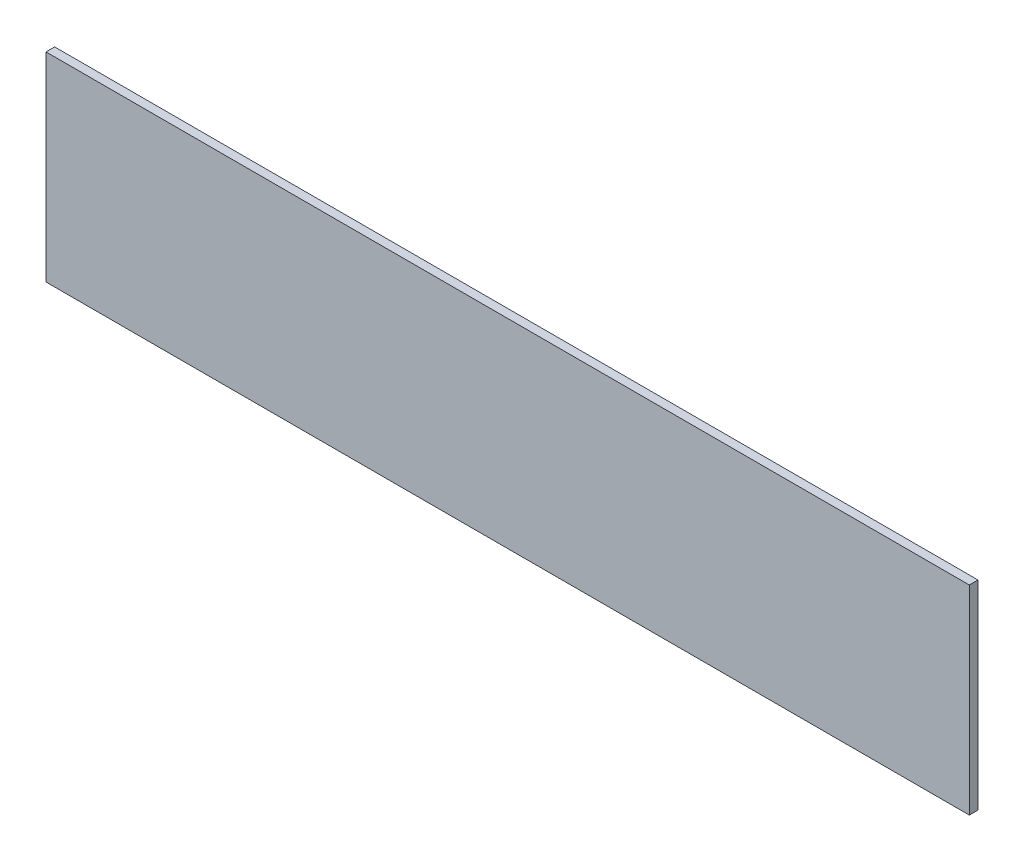
ISO-10303-21;
HEADER;
FILE_DESCRIPTION(('STEP AP214'),'2;1');
FILE_NAME('part.step','',(''),(''),'','','');
FILE_SCHEMA(('AUTOMOTIVE_DESIGN { 1 0 10303 214 1 1 1 1 }'));
ENDSEC;
DATA;
#1=APPLICATION_CONTEXT('core data for automotive mechanical design processes');
#2=APPLICATION_PROTOCOL_DEFINITION('international standard','automotive_design',2000,#1);
#3=PRODUCT_CONTEXT('',#1,'mechanical');
#4=PRODUCT('Part','Part','',(#3));
#5=PRODUCT_RELATED_PRODUCT_CATEGORY('part','',(#4));
#6=PRODUCT_DEFINITION_FORMATION('','',#4);
#7=PRODUCT_DEFINITION_CONTEXT('part definition',#1,'design');
#8=PRODUCT_DEFINITION('design','',#6,#7);
#9=PRODUCT_DEFINITION_SHAPE('','',#8);
#10=(LENGTH_UNIT() NAMED_UNIT(*) SI_UNIT(.MILLI.,.METRE.));
#11=(NAMED_UNIT(*) PLANE_ANGLE_UNIT() SI_UNIT($,.RADIAN.));
#12=(NAMED_UNIT(*) SI_UNIT($,.STERADIAN.) SOLID_ANGLE_UNIT());
#13=UNCERTAINTY_MEASURE_WITH_UNIT(LENGTH_MEASURE(1.E-05),#10,'distance_accuracy_value','');
#14=(GEOMETRIC_REPRESENTATION_CONTEXT(3) GLOBAL_UNCERTAINTY_ASSIGNED_CONTEXT((#13)) GLOBAL_UNIT_ASSIGNED_CONTEXT((#10,
#11,#12)) REPRESENTATION_CONTEXT('',''));
#15=CARTESIAN_POINT('',(0.,0.,0.));
#16=DIRECTION('',(0.,0.,1.));
#17=DIRECTION('',(1.,0.,0.));
#18=AXIS2_PLACEMENT_3D('',#15,#16,#17);
#19=CARTESIAN_POINT('',(1.5875,76.2,-3.175));
#20=DIRECTION('',(-1.,0.,0.));
#21=DIRECTION('',(0.,-1.,0.));
#22=AXIS2_PLACEMENT_3D('',#19,#20,#21);
#23=PLANE('',#22);
#24=DIRECTION('',(0.,-1.,0.));
#25=VECTOR('',#24,1.);
#26=CARTESIAN_POINT('',(1.5875,76.2,0.));
#27=LINE('',#26,#25);
#28=CARTESIAN_POINT('',(1.5875,76.2,0.));
#29=VERTEX_POINT('',#28);
#30=CARTESIAN_POINT('',(1.58750000000001,3.17499999999996,0.));
#31=VERTEX_POINT('',#30);
#32=EDGE_CURVE('E96',#29,#31,#27,.T.);
#33=ORIENTED_EDGE('',*,*,#32,.F.);
#34=DIRECTION('',(0.,0.,1.));
#35=VECTOR('',#34,1.);
#36=CARTESIAN_POINT('',(1.5875,76.2,-3.175));
#37=LINE('',#36,#35);
#38=CARTESIAN_POINT('',(1.5875,76.2,-3.175));
#39=VERTEX_POINT('',#38);
#40=EDGE_CURVE('E11',#39,#29,#37,.T.);
#41=ORIENTED_EDGE('',*,*,#40,.F.);
#42=DIRECTION('',(0.,-1.,0.));
#43=VECTOR('',#42,1.);
#44=CARTESIAN_POINT('',(1.5875,76.2,-3.175));
#45=LINE('',#44,#43);
#46=CARTESIAN_POINT('',(1.58750000000001,3.17499999999996,-3.175));
#47=VERTEX_POINT('',#46);
#48=EDGE_CURVE('E90',#39,#47,#45,.T.);
#49=ORIENTED_EDGE('',*,*,#48,.T.);
#50=DIRECTION('',(0.,0.,1.));
#51=VECTOR('',#50,1.);
#52=CARTESIAN_POINT('',(1.58750000000001,3.17499999999996,-3.175));
#53=LINE('',#52,#51);
#54=EDGE_CURVE('E35',#47,#31,#53,.T.);
#55=ORIENTED_EDGE('',*,*,#54,.T.);
#56=EDGE_LOOP('',(#33,#41,#49,#55));
#57=FACE_BOUND('',#56,.T.);
#58=ADVANCED_FACE('F32',(#57),#23,.T.);
#59=CARTESIAN_POINT('',(1.5875,76.2,-3.175));
#60=DIRECTION('',(0.,1.,0.));
#61=DIRECTION('',(-1.,0.,0.));
#62=AXIS2_PLACEMENT_3D('',#59,#60,#61);
#63=PLANE('',#62);
#64=DIRECTION('',(-1.,0.,0.));
#65=VECTOR('',#64,1.);
#66=CARTESIAN_POINT('',(1.5875,76.2,0.));
#67=LINE('',#66,#65);
#68=CARTESIAN_POINT('',(339.912500000039,76.2000000000001,0.));
#69=VERTEX_POINT('',#68);
#70=EDGE_CURVE('E92',#69,#29,#67,.T.);
#71=ORIENTED_EDGE('',*,*,#70,.F.);
#72=DIRECTION('',(0.,0.,1.));
#73=VECTOR('',#72,1.);
#74=CARTESIAN_POINT('',(339.912500000039,76.2000000000001,-3.175));
#75=LINE('',#74,#73);
#76=CARTESIAN_POINT('',(339.912500000039,76.2000000000001,-3.175));
#77=VERTEX_POINT('',#76);
#78=EDGE_CURVE('E41',#77,#69,#75,.T.);
#79=ORIENTED_EDGE('',*,*,#78,.F.);
#80=DIRECTION('',(-1.,0.,0.));
#81=VECTOR('',#80,1.);
#82=CARTESIAN_POINT('',(1.5875,76.2,-3.175));
#83=LINE('',#82,#81);
#84=EDGE_CURVE('E87',#77,#39,#83,.T.);
#85=ORIENTED_EDGE('',*,*,#84,.T.);
#86=ORIENTED_EDGE('',*,*,#40,.T.);
#87=EDGE_LOOP('',(#71,#79,#85,#86));
#88=FACE_BOUND('',#87,.T.);
#89=ADVANCED_FACE('F106',(#88),#63,.T.);
#90=CARTESIAN_POINT('',(339.912500000039,76.2000000000001,-3.175));
#91=DIRECTION('',(1.,0.,0.));
#92=DIRECTION('',(0.,0.,-1.));
#93=AXIS2_PLACEMENT_3D('',#90,#91,#92);
#94=PLANE('',#93);
#95=DIRECTION('',(0.,1.,0.));
#96=VECTOR('',#95,1.);
#97=CARTESIAN_POINT('',(339.912500000039,76.2000000000001,0.));
#98=LINE('',#97,#96);
#99=CARTESIAN_POINT('',(339.912500000039,3.17500000000009,0.));
#100=VERTEX_POINT('',#99);
#101=EDGE_CURVE('E82',#100,#69,#98,.T.);
#102=ORIENTED_EDGE('',*,*,#101,.F.);
#103=DIRECTION('',(0.,0.,1.));
#104=VECTOR('',#103,1.);
#105=CARTESIAN_POINT('',(339.912500000039,3.17500000000009,-3.175));
#106=LINE('',#105,#104);
#107=CARTESIAN_POINT('',(339.912500000039,3.17500000000009,-3.175));
#108=VERTEX_POINT('',#107);
#109=EDGE_CURVE('E77',#108,#100,#106,.T.);
#110=ORIENTED_EDGE('',*,*,#109,.F.);
#111=DIRECTION('',(0.,1.,0.));
#112=VECTOR('',#111,1.);
#113=CARTESIAN_POINT('',(339.912500000039,76.2000000000001,-3.175));
#114=LINE('',#113,#112);
#115=EDGE_CURVE('E80',#108,#77,#114,.T.);
#116=ORIENTED_EDGE('',*,*,#115,.T.);
#117=ORIENTED_EDGE('',*,*,#78,.T.);
#118=EDGE_LOOP('',(#102,#110,#116,#117));
#119=FACE_BOUND('',#118,.T.);
#120=ADVANCED_FACE('F79',(#119),#94,.T.);
#121=CARTESIAN_POINT('',(1.58750000000001,3.17499999999996,-3.175));
#122=DIRECTION('',(0.,-1.,0.));
#123=DIRECTION('',(1.,0.,0.));
#124=AXIS2_PLACEMENT_3D('',#121,#122,#123);
#125=PLANE('',#124);
#126=DIRECTION('',(1.,0.,0.));
#127=VECTOR('',#126,1.);
#128=CARTESIAN_POINT('',(1.58750000000001,3.17499999999996,0.));
#129=LINE('',#128,#127);
#130=EDGE_CURVE('E99',#31,#100,#129,.T.);
#131=ORIENTED_EDGE('',*,*,#130,.F.);
#132=ORIENTED_EDGE('',*,*,#54,.F.);
#133=DIRECTION('',(1.,0.,0.));
#134=VECTOR('',#133,1.);
#135=CARTESIAN_POINT('',(1.58750000000001,3.17499999999996,-3.175));
#136=LINE('',#135,#134);
#137=EDGE_CURVE('E86',#47,#108,#136,.T.);
#138=ORIENTED_EDGE('',*,*,#137,.T.);
#139=ORIENTED_EDGE('',*,*,#109,.T.);
#140=EDGE_LOOP('',(#131,#132,#138,#139));
#141=FACE_BOUND('',#140,.T.);
#142=ADVANCED_FACE('F89',(#141),#125,.T.);
#143=CARTESIAN_POINT('',(0.,0.,-3.175));
#144=DIRECTION('',(0.,0.,1.));
#145=DIRECTION('',(1.,0.,0.));
#146=AXIS2_PLACEMENT_3D('',#143,#144,#145);
#147=PLANE('',#146);
#148=ORIENTED_EDGE('',*,*,#48,.F.);
#149=ORIENTED_EDGE('',*,*,#84,.F.);
#150=ORIENTED_EDGE('',*,*,#115,.F.);
#151=ORIENTED_EDGE('',*,*,#137,.F.);
#152=EDGE_LOOP('',(#148,#149,#150,#151));
#153=FACE_BOUND('',#152,.T.);
#154=ADVANCED_FACE('F85',(#153),#147,.F.);
#155=CARTESIAN_POINT('',(0.,0.,0.));
#156=DIRECTION('',(0.,0.,1.));
#157=DIRECTION('',(1.,0.,0.));
#158=AXIS2_PLACEMENT_3D('',#155,#156,#157);
#159=PLANE('',#158);
#160=ORIENTED_EDGE('',*,*,#32,.T.);
#161=ORIENTED_EDGE('',*,*,#130,.T.);
#162=ORIENTED_EDGE('',*,*,#101,.T.);
#163=ORIENTED_EDGE('',*,*,#70,.T.);
#164=EDGE_LOOP('',(#160,#161,#162,#163));
#165=FACE_BOUND('',#164,.T.);
#166=ADVANCED_FACE('F105',(#165),#159,.T.);
#167=CLOSED_SHELL('',(#58,#89,#120,#142,#154,#166));
#168=MANIFOLD_SOLID_BREP('B2',#167);
#169=ADVANCED_BREP_SHAPE_REPRESENTATION('',(#18,#168),#14);
#170=SHAPE_DEFINITION_REPRESENTATION(#9,#169);
ENDSEC;
END-ISO-10303-21;
